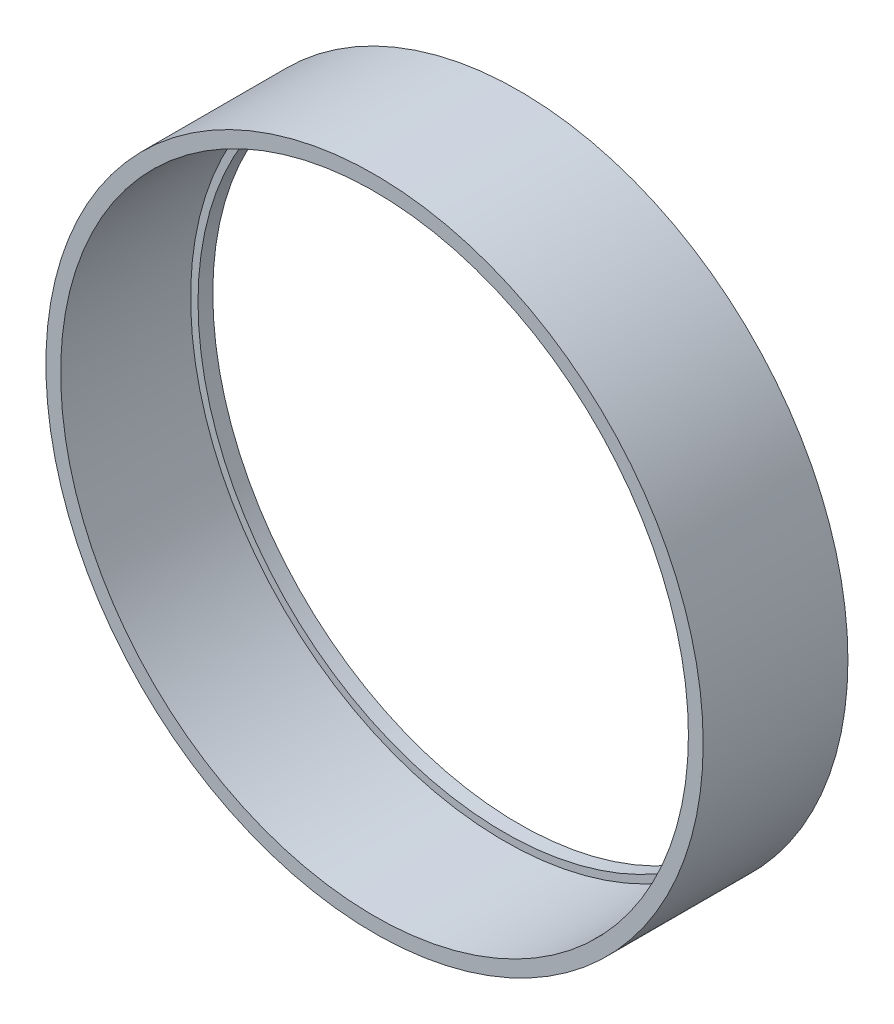
ISO-10303-21;
HEADER;
FILE_DESCRIPTION(('STEP AP214'),'2;1');
FILE_NAME('part.step','',(''),(''),'','','');
FILE_SCHEMA(('AUTOMOTIVE_DESIGN { 1 0 10303 214 1 1 1 1 }'));
ENDSEC;
DATA;
#1=APPLICATION_CONTEXT('core data for automotive mechanical design processes');
#2=APPLICATION_PROTOCOL_DEFINITION('international standard','automotive_design',2000,#1);
#3=PRODUCT_CONTEXT('',#1,'mechanical');
#4=PRODUCT('Part','Part','',(#3));
#5=PRODUCT_RELATED_PRODUCT_CATEGORY('part','',(#4));
#6=PRODUCT_DEFINITION_FORMATION('','',#4);
#7=PRODUCT_DEFINITION_CONTEXT('part definition',#1,'design');
#8=PRODUCT_DEFINITION('design','',#6,#7);
#9=PRODUCT_DEFINITION_SHAPE('','',#8);
#10=(LENGTH_UNIT() NAMED_UNIT(*) SI_UNIT(.MILLI.,.METRE.));
#11=(NAMED_UNIT(*) PLANE_ANGLE_UNIT() SI_UNIT($,.RADIAN.));
#12=(NAMED_UNIT(*) SI_UNIT($,.STERADIAN.) SOLID_ANGLE_UNIT());
#13=UNCERTAINTY_MEASURE_WITH_UNIT(LENGTH_MEASURE(1.E-05),#10,'distance_accuracy_value','');
#14=(GEOMETRIC_REPRESENTATION_CONTEXT(3) GLOBAL_UNCERTAINTY_ASSIGNED_CONTEXT((#13)) GLOBAL_UNIT_ASSIGNED_CONTEXT((#10,
#11,#12)) REPRESENTATION_CONTEXT('',''));
#15=CARTESIAN_POINT('',(0.,0.,0.));
#16=DIRECTION('',(0.,0.,1.));
#17=DIRECTION('',(1.,0.,0.));
#18=AXIS2_PLACEMENT_3D('',#15,#16,#17);
#19=CARTESIAN_POINT('',(0.,0.,9.8));
#20=DIRECTION('',(0.,0.,-1.));
#21=DIRECTION('',(-1.,0.,0.));
#22=AXIS2_PLACEMENT_3D('',#19,#20,#21);
#23=CYLINDRICAL_SURFACE('',#22,21.25);
#24=CARTESIAN_POINT('',(0.,0.,0.999999999999999));
#25=DIRECTION('',(0.,0.,1.));
#26=DIRECTION('',(1.,0.,0.));
#27=AXIS2_PLACEMENT_3D('',#24,#25,#26);
#28=CIRCLE('',#27,21.25);
#29=CARTESIAN_POINT('',(21.25,0.,0.999999999999999));
#30=VERTEX_POINT('',#29);
#31=EDGE_CURVE('E10',#30,#30,#28,.T.);
#32=ORIENTED_EDGE('',*,*,#31,.F.);
#33=EDGE_LOOP('',(#32));
#34=FACE_BOUND('',#33,.T.);
#35=CARTESIAN_POINT('',(0.,0.,9.8));
#36=DIRECTION('',(0.,0.,1.));
#37=DIRECTION('',(1.,0.,0.));
#38=AXIS2_PLACEMENT_3D('',#35,#36,#37);
#39=CIRCLE('',#38,21.25);
#40=CARTESIAN_POINT('',(21.25,0.,9.8));
#41=VERTEX_POINT('',#40);
#42=EDGE_CURVE('E44',#41,#41,#39,.T.);
#43=ORIENTED_EDGE('',*,*,#42,.T.);
#44=EDGE_LOOP('',(#43));
#45=FACE_BOUND('',#44,.T.);
#46=ADVANCED_FACE('F34',(#34,#45),#23,.F.);
#47=CARTESIAN_POINT('',(0.,0.,9.8));
#48=DIRECTION('',(0.,0.,-1.));
#49=DIRECTION('',(-1.,0.,0.));
#50=AXIS2_PLACEMENT_3D('',#47,#48,#49);
#51=CYLINDRICAL_SURFACE('',#50,22.25);
#52=CARTESIAN_POINT('',(0.,0.,9.8));
#53=DIRECTION('',(0.,0.,1.));
#54=DIRECTION('',(1.,0.,0.));
#55=AXIS2_PLACEMENT_3D('',#52,#53,#54);
#56=CIRCLE('',#55,22.25);
#57=CARTESIAN_POINT('',(22.25,0.,9.8));
#58=VERTEX_POINT('',#57);
#59=EDGE_CURVE('E40',#58,#58,#56,.T.);
#60=ORIENTED_EDGE('',*,*,#59,.F.);
#61=EDGE_LOOP('',(#60));
#62=FACE_BOUND('',#61,.T.);
#63=CARTESIAN_POINT('',(0.,0.,0.));
#64=DIRECTION('',(0.,0.,1.));
#65=DIRECTION('',(1.,0.,0.));
#66=AXIS2_PLACEMENT_3D('',#63,#64,#65);
#67=CIRCLE('',#66,22.25);
#68=CARTESIAN_POINT('',(22.25,0.,0.));
#69=VERTEX_POINT('',#68);
#70=EDGE_CURVE('E49',#69,#69,#67,.T.);
#71=ORIENTED_EDGE('',*,*,#70,.T.);
#72=EDGE_LOOP('',(#71));
#73=FACE_BOUND('',#72,.T.);
#74=ADVANCED_FACE('F81',(#62,#73),#51,.T.);
#75=CARTESIAN_POINT('',(0.,0.,9.8));
#76=DIRECTION('',(0.,0.,1.));
#77=DIRECTION('',(1.,0.,0.));
#78=AXIS2_PLACEMENT_3D('',#75,#76,#77);
#79=PLANE('',#78);
#80=ORIENTED_EDGE('',*,*,#42,.F.);
#81=EDGE_LOOP('',(#80));
#82=FACE_BOUND('',#81,.T.);
#83=ORIENTED_EDGE('',*,*,#59,.T.);
#84=EDGE_LOOP('',(#83));
#85=FACE_BOUND('',#84,.T.);
#86=ADVANCED_FACE('F76',(#82,#85),#79,.T.);
#87=CARTESIAN_POINT('',(0.,0.,0.));
#88=DIRECTION('',(0.,0.,1.));
#89=DIRECTION('',(1.,0.,0.));
#90=AXIS2_PLACEMENT_3D('',#87,#88,#89);
#91=PLANE('',#90);
#92=ORIENTED_EDGE('',*,*,#70,.F.);
#93=EDGE_LOOP('',(#92));
#94=FACE_BOUND('',#93,.T.);
#95=CARTESIAN_POINT('',(0.,0.,0.));
#96=DIRECTION('',(0.,0.,1.));
#97=DIRECTION('',(1.,0.,0.));
#98=AXIS2_PLACEMENT_3D('',#95,#96,#97);
#99=CIRCLE('',#98,20.75);
#100=CARTESIAN_POINT('',(20.75,0.,0.));
#101=VERTEX_POINT('',#100);
#102=EDGE_CURVE('E57',#101,#101,#99,.T.);
#103=ORIENTED_EDGE('',*,*,#102,.T.);
#104=EDGE_LOOP('',(#103));
#105=FACE_BOUND('',#104,.T.);
#106=ADVANCED_FACE('F64',(#94,#105),#91,.F.);
#107=CARTESIAN_POINT('',(0.,0.,1.));
#108=DIRECTION('',(0.,0.,-1.));
#109=DIRECTION('',(-1.,0.,0.));
#110=AXIS2_PLACEMENT_3D('',#107,#108,#109);
#111=CYLINDRICAL_SURFACE('',#110,20.75);
#112=CARTESIAN_POINT('',(0.,0.,1.));
#113=DIRECTION('',(0.,0.,1.));
#114=DIRECTION('',(1.,0.,0.));
#115=AXIS2_PLACEMENT_3D('',#112,#113,#114);
#116=CIRCLE('',#115,20.75);
#117=CARTESIAN_POINT('',(20.75,0.,1.));
#118=VERTEX_POINT('',#117);
#119=EDGE_CURVE('E53',#118,#118,#116,.T.);
#120=ORIENTED_EDGE('',*,*,#119,.T.);
#121=EDGE_LOOP('',(#120));
#122=FACE_BOUND('',#121,.T.);
#123=ORIENTED_EDGE('',*,*,#102,.F.);
#124=EDGE_LOOP('',(#123));
#125=FACE_BOUND('',#124,.T.);
#126=ADVANCED_FACE('F66',(#122,#125),#111,.F.);
#127=CARTESIAN_POINT('',(0.,0.,1.));
#128=DIRECTION('',(0.,0.,1.));
#129=DIRECTION('',(1.,0.,0.));
#130=AXIS2_PLACEMENT_3D('',#127,#128,#129);
#131=PLANE('',#130);
#132=ORIENTED_EDGE('',*,*,#119,.F.);
#133=EDGE_LOOP('',(#132));
#134=FACE_BOUND('',#133,.T.);
#135=ORIENTED_EDGE('',*,*,#31,.T.);
#136=EDGE_LOOP('',(#135));
#137=FACE_BOUND('',#136,.T.);
#138=ADVANCED_FACE('F68',(#134,#137),#131,.T.);
#139=CLOSED_SHELL('',(#46,#74,#86,#106,#126,#138));
#140=MANIFOLD_SOLID_BREP('B2',#139);
#141=ADVANCED_BREP_SHAPE_REPRESENTATION('',(#18,#140),#14);
#142=SHAPE_DEFINITION_REPRESENTATION(#9,#141);
ENDSEC;
END-ISO-10303-21;
